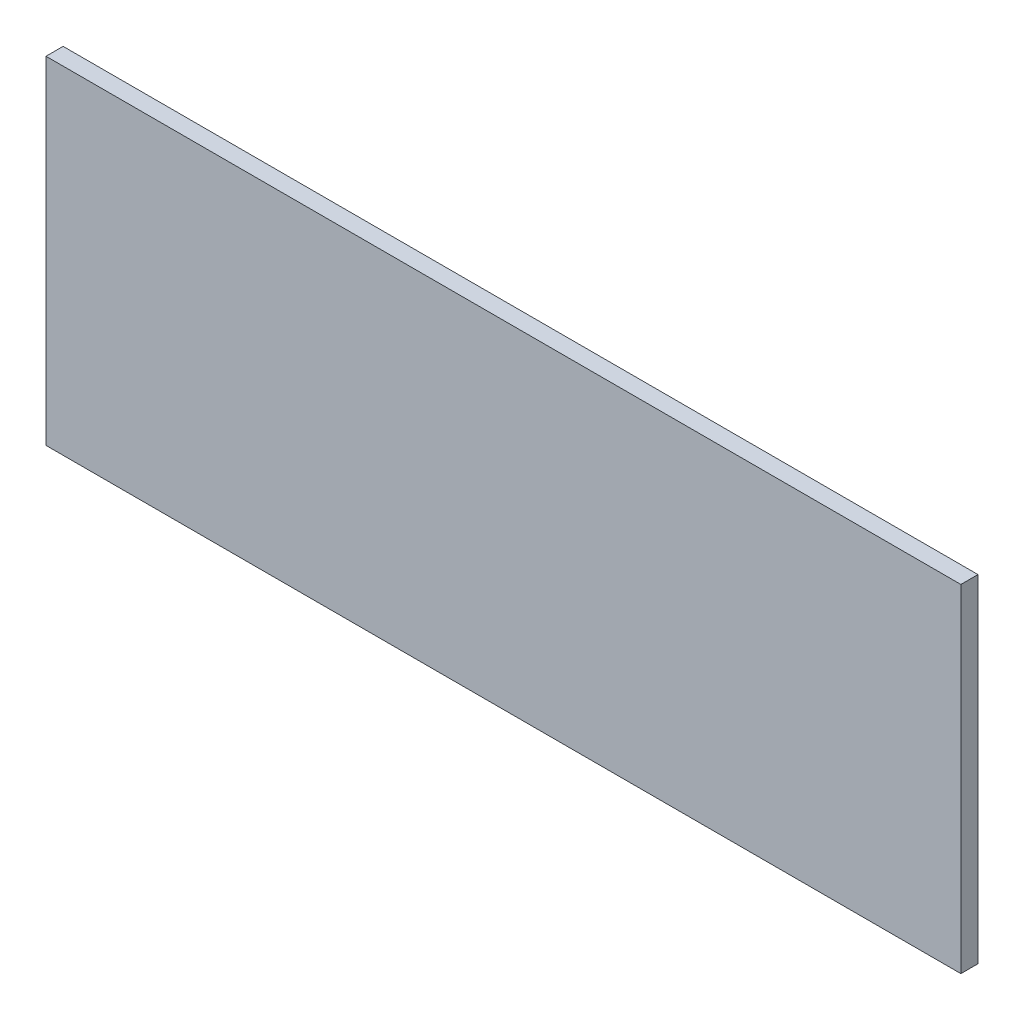
ISO-10303-21;
HEADER;
FILE_DESCRIPTION(('STEP AP214'),'2;1');
FILE_NAME('part.step','',(''),(''),'','','');
FILE_SCHEMA(('AUTOMOTIVE_DESIGN { 1 0 10303 214 1 1 1 1 }'));
ENDSEC;
DATA;
#1=APPLICATION_CONTEXT('core data for automotive mechanical design processes');
#2=APPLICATION_PROTOCOL_DEFINITION('international standard','automotive_design',2000,#1);
#3=PRODUCT_CONTEXT('',#1,'mechanical');
#4=PRODUCT('Part','Part','',(#3));
#5=PRODUCT_RELATED_PRODUCT_CATEGORY('part','',(#4));
#6=PRODUCT_DEFINITION_FORMATION('','',#4);
#7=PRODUCT_DEFINITION_CONTEXT('part definition',#1,'design');
#8=PRODUCT_DEFINITION('design','',#6,#7);
#9=PRODUCT_DEFINITION_SHAPE('','',#8);
#10=(LENGTH_UNIT() NAMED_UNIT(*) SI_UNIT(.MILLI.,.METRE.));
#11=(NAMED_UNIT(*) PLANE_ANGLE_UNIT() SI_UNIT($,.RADIAN.));
#12=(NAMED_UNIT(*) SI_UNIT($,.STERADIAN.) SOLID_ANGLE_UNIT());
#13=UNCERTAINTY_MEASURE_WITH_UNIT(LENGTH_MEASURE(1.E-05),#10,'distance_accuracy_value','');
#14=(GEOMETRIC_REPRESENTATION_CONTEXT(3) GLOBAL_UNCERTAINTY_ASSIGNED_CONTEXT((#13)) GLOBAL_UNIT_ASSIGNED_CONTEXT((#10,
#11,#12)) REPRESENTATION_CONTEXT('',''));
#15=CARTESIAN_POINT('',(0.,0.,0.));
#16=DIRECTION('',(0.,0.,1.));
#17=DIRECTION('',(1.,0.,0.));
#18=AXIS2_PLACEMENT_3D('',#15,#16,#17);
#19=CARTESIAN_POINT('',(81.8669967651367,58.8370018005371,0.));
#20=DIRECTION('',(0.,1.,0.));
#21=DIRECTION('',(1.,0.,0.));
#22=AXIS2_PLACEMENT_3D('',#19,#20,#21);
#23=PLANE('',#22);
#24=DIRECTION('',(1.,0.,0.));
#25=VECTOR('',#24,1.);
#26=CARTESIAN_POINT('',(81.8669967651367,58.8370018005371,0.03556));
#27=LINE('',#26,#25);
#28=CARTESIAN_POINT('',(81.8669967651367,58.8370018005371,0.03556));
#29=VERTEX_POINT('',#28);
#30=CARTESIAN_POINT('',(83.7669982910156,58.8370018005371,0.03556));
#31=VERTEX_POINT('',#30);
#32=EDGE_CURVE('E11',#29,#31,#27,.T.);
#33=ORIENTED_EDGE('',*,*,#32,.F.);
#34=DIRECTION('',(0.,0.,1.));
#35=VECTOR('',#34,1.);
#36=CARTESIAN_POINT('',(81.8669967651367,58.8370018005371,0.));
#37=LINE('',#36,#35);
#38=CARTESIAN_POINT('',(81.8669967651367,58.8370018005371,0.));
#39=VERTEX_POINT('',#38);
#40=EDGE_CURVE('E24',#39,#29,#37,.T.);
#41=ORIENTED_EDGE('',*,*,#40,.F.);
#42=DIRECTION('',(1.,0.,0.));
#43=VECTOR('',#42,1.);
#44=CARTESIAN_POINT('',(81.8669967651367,58.8370018005371,0.));
#45=LINE('',#44,#43);
#46=CARTESIAN_POINT('',(83.7669982910156,58.8370018005371,0.));
#47=VERTEX_POINT('',#46);
#48=EDGE_CURVE('E75',#39,#47,#45,.T.);
#49=ORIENTED_EDGE('',*,*,#48,.T.);
#50=DIRECTION('',(0.,0.,1.));
#51=VECTOR('',#50,1.);
#52=CARTESIAN_POINT('',(83.7669982910156,58.8370018005371,0.));
#53=LINE('',#52,#51);
#54=EDGE_CURVE('E37',#47,#31,#53,.T.);
#55=ORIENTED_EDGE('',*,*,#54,.T.);
#56=EDGE_LOOP('',(#33,#41,#49,#55));
#57=FACE_BOUND('',#56,.T.);
#58=ADVANCED_FACE('F17',(#57),#23,.F.);
#59=CARTESIAN_POINT('',(83.7669982910156,58.8370018005371,0.));
#60=DIRECTION('',(-1.,0.,0.));
#61=DIRECTION('',(0.,1.,0.));
#62=AXIS2_PLACEMENT_3D('',#59,#60,#61);
#63=PLANE('',#62);
#64=DIRECTION('',(0.,1.,0.));
#65=VECTOR('',#64,1.);
#66=CARTESIAN_POINT('',(83.7669982910156,58.8370018005371,0.03556));
#67=LINE('',#66,#65);
#68=CARTESIAN_POINT('',(83.7669982910156,59.5369987487793,0.03556));
#69=VERTEX_POINT('',#68);
#70=EDGE_CURVE('E83',#31,#69,#67,.T.);
#71=ORIENTED_EDGE('',*,*,#70,.F.);
#72=ORIENTED_EDGE('',*,*,#54,.F.);
#73=DIRECTION('',(0.,1.,0.));
#74=VECTOR('',#73,1.);
#75=CARTESIAN_POINT('',(83.7669982910156,58.8370018005371,0.));
#76=LINE('',#75,#74);
#77=CARTESIAN_POINT('',(83.7669982910156,59.5369987487793,0.));
#78=VERTEX_POINT('',#77);
#79=EDGE_CURVE('E81',#47,#78,#76,.T.);
#80=ORIENTED_EDGE('',*,*,#79,.T.);
#81=DIRECTION('',(0.,0.,1.));
#82=VECTOR('',#81,1.);
#83=CARTESIAN_POINT('',(83.7669982910156,59.5369987487793,0.));
#84=LINE('',#83,#82);
#85=EDGE_CURVE('E67',#78,#69,#84,.T.);
#86=ORIENTED_EDGE('',*,*,#85,.T.);
#87=EDGE_LOOP('',(#71,#72,#80,#86));
#88=FACE_BOUND('',#87,.T.);
#89=ADVANCED_FACE('F89',(#88),#63,.F.);
#90=CARTESIAN_POINT('',(83.7669982910156,59.5369987487793,0.));
#91=DIRECTION('',(0.,-1.,0.));
#92=DIRECTION('',(-1.,0.,0.));
#93=AXIS2_PLACEMENT_3D('',#90,#91,#92);
#94=PLANE('',#93);
#95=DIRECTION('',(-1.,0.,0.));
#96=VECTOR('',#95,1.);
#97=CARTESIAN_POINT('',(83.7669982910156,59.5369987487793,0.03556));
#98=LINE('',#97,#96);
#99=CARTESIAN_POINT('',(81.8669967651367,59.5369987487793,0.03556));
#100=VERTEX_POINT('',#99);
#101=EDGE_CURVE('E71',#69,#100,#98,.T.);
#102=ORIENTED_EDGE('',*,*,#101,.F.);
#103=ORIENTED_EDGE('',*,*,#85,.F.);
#104=DIRECTION('',(-1.,0.,0.));
#105=VECTOR('',#104,1.);
#106=CARTESIAN_POINT('',(83.7669982910156,59.5369987487793,0.));
#107=LINE('',#106,#105);
#108=CARTESIAN_POINT('',(81.8669967651367,59.5369987487793,0.));
#109=VERTEX_POINT('',#108);
#110=EDGE_CURVE('E63',#78,#109,#107,.T.);
#111=ORIENTED_EDGE('',*,*,#110,.T.);
#112=DIRECTION('',(0.,0.,1.));
#113=VECTOR('',#112,1.);
#114=CARTESIAN_POINT('',(81.8669967651367,59.5369987487793,0.));
#115=LINE('',#114,#113);
#116=EDGE_CURVE('E53',#109,#100,#115,.T.);
#117=ORIENTED_EDGE('',*,*,#116,.T.);
#118=EDGE_LOOP('',(#102,#103,#111,#117));
#119=FACE_BOUND('',#118,.T.);
#120=ADVANCED_FACE('F66',(#119),#94,.F.);
#121=CARTESIAN_POINT('',(81.8669967651367,59.5369987487793,0.));
#122=DIRECTION('',(1.,0.,0.));
#123=DIRECTION('',(0.,-1.,0.));
#124=AXIS2_PLACEMENT_3D('',#121,#122,#123);
#125=PLANE('',#124);
#126=DIRECTION('',(0.,-1.,0.));
#127=VECTOR('',#126,1.);
#128=CARTESIAN_POINT('',(81.8669967651367,59.5369987487793,0.03556));
#129=LINE('',#128,#127);
#130=EDGE_CURVE('E59',#100,#29,#129,.T.);
#131=ORIENTED_EDGE('',*,*,#130,.F.);
#132=ORIENTED_EDGE('',*,*,#116,.F.);
#133=DIRECTION('',(0.,-1.,0.));
#134=VECTOR('',#133,1.);
#135=CARTESIAN_POINT('',(81.8669967651367,59.5369987487793,0.));
#136=LINE('',#135,#134);
#137=EDGE_CURVE('E57',#109,#39,#136,.T.);
#138=ORIENTED_EDGE('',*,*,#137,.T.);
#139=ORIENTED_EDGE('',*,*,#40,.T.);
#140=EDGE_LOOP('',(#131,#132,#138,#139));
#141=FACE_BOUND('',#140,.T.);
#142=ADVANCED_FACE('F55',(#141),#125,.F.);
#143=CARTESIAN_POINT('',(81.8669967651367,58.8370018005371,0.));
#144=DIRECTION('',(0.,0.,-1.));
#145=DIRECTION('',(-1.,0.,0.));
#146=AXIS2_PLACEMENT_3D('',#143,#144,#145);
#147=PLANE('',#146);
#148=ORIENTED_EDGE('',*,*,#137,.F.);
#149=ORIENTED_EDGE('',*,*,#110,.F.);
#150=ORIENTED_EDGE('',*,*,#79,.F.);
#151=ORIENTED_EDGE('',*,*,#48,.F.);
#152=EDGE_LOOP('',(#148,#149,#150,#151));
#153=FACE_BOUND('',#152,.T.);
#154=ADVANCED_FACE('F74',(#153),#147,.T.);
#155=CARTESIAN_POINT('',(81.8669967651367,58.8370018005371,0.03556));
#156=DIRECTION('',(0.,0.,-1.));
#157=DIRECTION('',(-1.,0.,0.));
#158=AXIS2_PLACEMENT_3D('',#155,#156,#157);
#159=PLANE('',#158);
#160=ORIENTED_EDGE('',*,*,#32,.T.);
#161=ORIENTED_EDGE('',*,*,#70,.T.);
#162=ORIENTED_EDGE('',*,*,#101,.T.);
#163=ORIENTED_EDGE('',*,*,#130,.T.);
#164=EDGE_LOOP('',(#160,#161,#162,#163));
#165=FACE_BOUND('',#164,.T.);
#166=ADVANCED_FACE('F91',(#165),#159,.F.);
#167=CLOSED_SHELL('',(#58,#89,#120,#142,#154,#166));
#168=MANIFOLD_SOLID_BREP('B1',#167);
#169=ADVANCED_BREP_SHAPE_REPRESENTATION('',(#18,#168),#14);
#170=SHAPE_DEFINITION_REPRESENTATION(#9,#169);
ENDSEC;
END-ISO-10303-21;
